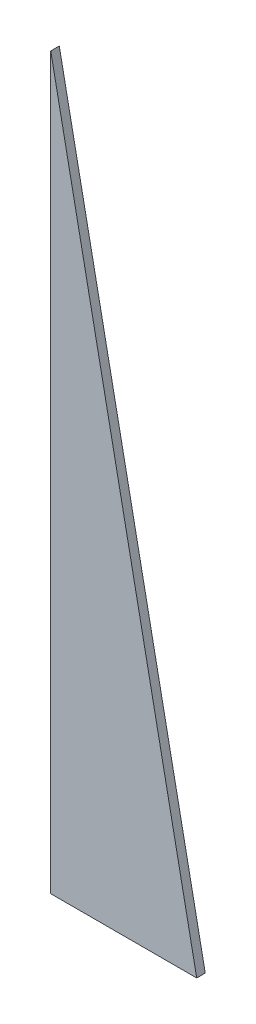
ISO-10303-21;
HEADER;
FILE_DESCRIPTION(('STEP AP214'),'2;1');
FILE_NAME('part.step','',(''),(''),'','','');
FILE_SCHEMA(('AUTOMOTIVE_DESIGN { 1 0 10303 214 1 1 1 1 }'));
ENDSEC;
DATA;
#1=APPLICATION_CONTEXT('core data for automotive mechanical design processes');
#2=APPLICATION_PROTOCOL_DEFINITION('international standard','automotive_design',2000,#1);
#3=PRODUCT_CONTEXT('',#1,'mechanical');
#4=PRODUCT('Part','Part','',(#3));
#5=PRODUCT_RELATED_PRODUCT_CATEGORY('part','',(#4));
#6=PRODUCT_DEFINITION_FORMATION('','',#4);
#7=PRODUCT_DEFINITION_CONTEXT('part definition',#1,'design');
#8=PRODUCT_DEFINITION('design','',#6,#7);
#9=PRODUCT_DEFINITION_SHAPE('','',#8);
#10=(LENGTH_UNIT() NAMED_UNIT(*) SI_UNIT(.MILLI.,.METRE.));
#11=(NAMED_UNIT(*) PLANE_ANGLE_UNIT() SI_UNIT($,.RADIAN.));
#12=(NAMED_UNIT(*) SI_UNIT($,.STERADIAN.) SOLID_ANGLE_UNIT());
#13=UNCERTAINTY_MEASURE_WITH_UNIT(LENGTH_MEASURE(1.E-05),#10,'distance_accuracy_value','');
#14=(GEOMETRIC_REPRESENTATION_CONTEXT(3) GLOBAL_UNCERTAINTY_ASSIGNED_CONTEXT((#13)) GLOBAL_UNIT_ASSIGNED_CONTEXT((#10,
#11,#12)) REPRESENTATION_CONTEXT('',''));
#15=CARTESIAN_POINT('',(0.,0.,0.));
#16=DIRECTION('',(0.,0.,1.));
#17=DIRECTION('',(1.,0.,0.));
#18=AXIS2_PLACEMENT_3D('',#15,#16,#17);
#19=CARTESIAN_POINT('',(-497.480672268907,-315.415966386555,2.));
#20=DIRECTION('',(-0.98058067569092,-0.196116135138184,0.));
#21=DIRECTION('',(0.196116135138184,-0.98058067569092,0.));
#22=AXIS2_PLACEMENT_3D('',#19,#20,#21);
#23=PLANE('',#22);
#24=DIRECTION('',(-0.196116135138184,0.98058067569092,0.));
#25=VECTOR('',#24,1.);
#26=CARTESIAN_POINT('',(-497.480672268907,-315.415966386555,0.));
#27=LINE('',#26,#25);
#28=CARTESIAN_POINT('',(-497.480672268907,-315.415966386555,0.));
#29=VERTEX_POINT('',#28);
#30=CARTESIAN_POINT('',(-531.680672268907,-144.415966386555,0.));
#31=VERTEX_POINT('',#30);
#32=EDGE_CURVE('E89',#29,#31,#27,.T.);
#33=ORIENTED_EDGE('',*,*,#32,.T.);
#34=DIRECTION('',(0.,0.,-1.));
#35=VECTOR('',#34,1.);
#36=CARTESIAN_POINT('',(-531.680672268907,-144.415966386555,2.));
#37=LINE('',#36,#35);
#38=CARTESIAN_POINT('',(-531.680672268907,-144.415966386555,2.));
#39=VERTEX_POINT('',#38);
#40=EDGE_CURVE('E11',#39,#31,#37,.T.);
#41=ORIENTED_EDGE('',*,*,#40,.F.);
#42=DIRECTION('',(-0.196116135138184,0.98058067569092,0.));
#43=VECTOR('',#42,1.);
#44=CARTESIAN_POINT('',(-497.480672268907,-315.415966386555,2.));
#45=LINE('',#44,#43);
#46=CARTESIAN_POINT('',(-497.480672268907,-315.415966386555,2.));
#47=VERTEX_POINT('',#46);
#48=EDGE_CURVE('E81',#47,#39,#45,.T.);
#49=ORIENTED_EDGE('',*,*,#48,.F.);
#50=DIRECTION('',(0.,0.,-1.));
#51=VECTOR('',#50,1.);
#52=CARTESIAN_POINT('',(-497.480672268907,-315.415966386555,2.));
#53=LINE('',#52,#51);
#54=EDGE_CURVE('E90',#47,#29,#53,.T.);
#55=ORIENTED_EDGE('',*,*,#54,.T.);
#56=EDGE_LOOP('',(#33,#41,#49,#55));
#57=FACE_BOUND('',#56,.T.);
#58=ADVANCED_FACE('F39',(#57),#23,.F.);
#59=CARTESIAN_POINT('',(-531.680672268907,-144.415966386555,2.));
#60=DIRECTION('',(1.,0.,0.));
#61=DIRECTION('',(0.,0.,-1.));
#62=AXIS2_PLACEMENT_3D('',#59,#60,#61);
#63=PLANE('',#62);
#64=DIRECTION('',(0.,-1.,0.));
#65=VECTOR('',#64,1.);
#66=CARTESIAN_POINT('',(-531.680672268907,-144.415966386555,0.));
#67=LINE('',#66,#65);
#68=CARTESIAN_POINT('',(-531.680672268907,-315.415966386555,0.));
#69=VERTEX_POINT('',#68);
#70=EDGE_CURVE('E68',#31,#69,#67,.T.);
#71=ORIENTED_EDGE('',*,*,#70,.T.);
#72=DIRECTION('',(0.,0.,-1.));
#73=VECTOR('',#72,1.);
#74=CARTESIAN_POINT('',(-531.680672268907,-315.415966386555,2.));
#75=LINE('',#74,#73);
#76=CARTESIAN_POINT('',(-531.680672268907,-315.415966386555,2.));
#77=VERTEX_POINT('',#76);
#78=EDGE_CURVE('E48',#77,#69,#75,.T.);
#79=ORIENTED_EDGE('',*,*,#78,.F.);
#80=DIRECTION('',(0.,-1.,0.));
#81=VECTOR('',#80,1.);
#82=CARTESIAN_POINT('',(-531.680672268907,-144.415966386555,2.));
#83=LINE('',#82,#81);
#84=EDGE_CURVE('E76',#39,#77,#83,.T.);
#85=ORIENTED_EDGE('',*,*,#84,.F.);
#86=ORIENTED_EDGE('',*,*,#40,.T.);
#87=EDGE_LOOP('',(#71,#79,#85,#86));
#88=FACE_BOUND('',#87,.T.);
#89=ADVANCED_FACE('F77',(#88),#63,.F.);
#90=CARTESIAN_POINT('',(-531.680672268907,-315.415966386555,2.));
#91=DIRECTION('',(0.,1.,0.));
#92=DIRECTION('',(0.,0.,1.));
#93=AXIS2_PLACEMENT_3D('',#90,#91,#92);
#94=PLANE('',#93);
#95=DIRECTION('',(1.,0.,0.));
#96=VECTOR('',#95,1.);
#97=CARTESIAN_POINT('',(-531.680672268907,-315.415966386555,0.));
#98=LINE('',#97,#96);
#99=EDGE_CURVE('E73',#69,#29,#98,.T.);
#100=ORIENTED_EDGE('',*,*,#99,.T.);
#101=ORIENTED_EDGE('',*,*,#54,.F.);
#102=DIRECTION('',(1.,0.,0.));
#103=VECTOR('',#102,1.);
#104=CARTESIAN_POINT('',(-531.680672268907,-315.415966386555,2.));
#105=LINE('',#104,#103);
#106=EDGE_CURVE('E56',#77,#47,#105,.T.);
#107=ORIENTED_EDGE('',*,*,#106,.F.);
#108=ORIENTED_EDGE('',*,*,#78,.T.);
#109=EDGE_LOOP('',(#100,#101,#107,#108));
#110=FACE_BOUND('',#109,.T.);
#111=ADVANCED_FACE('F102',(#110),#94,.F.);
#112=CARTESIAN_POINT('',(0.,0.,2.));
#113=DIRECTION('',(0.,0.,-1.));
#114=DIRECTION('',(-1.,0.,0.));
#115=AXIS2_PLACEMENT_3D('',#112,#113,#114);
#116=PLANE('',#115);
#117=ORIENTED_EDGE('',*,*,#48,.T.);
#118=ORIENTED_EDGE('',*,*,#84,.T.);
#119=ORIENTED_EDGE('',*,*,#106,.T.);
#120=EDGE_LOOP('',(#117,#118,#119));
#121=FACE_BOUND('',#120,.T.);
#122=ADVANCED_FACE('F84',(#121),#116,.F.);
#123=CARTESIAN_POINT('',(0.,0.,0.));
#124=DIRECTION('',(0.,0.,-1.));
#125=DIRECTION('',(-1.,0.,0.));
#126=AXIS2_PLACEMENT_3D('',#123,#124,#125);
#127=PLANE('',#126);
#128=ORIENTED_EDGE('',*,*,#32,.F.);
#129=ORIENTED_EDGE('',*,*,#99,.F.);
#130=ORIENTED_EDGE('',*,*,#70,.F.);
#131=EDGE_LOOP('',(#128,#129,#130));
#132=FACE_BOUND('',#131,.T.);
#133=ADVANCED_FACE('F103',(#132),#127,.T.);
#134=CLOSED_SHELL('',(#58,#89,#111,#122,#133));
#135=MANIFOLD_SOLID_BREP('B2',#134);
#136=ADVANCED_BREP_SHAPE_REPRESENTATION('',(#18,#135),#14);
#137=SHAPE_DEFINITION_REPRESENTATION(#9,#136);
ENDSEC;
END-ISO-10303-21;
